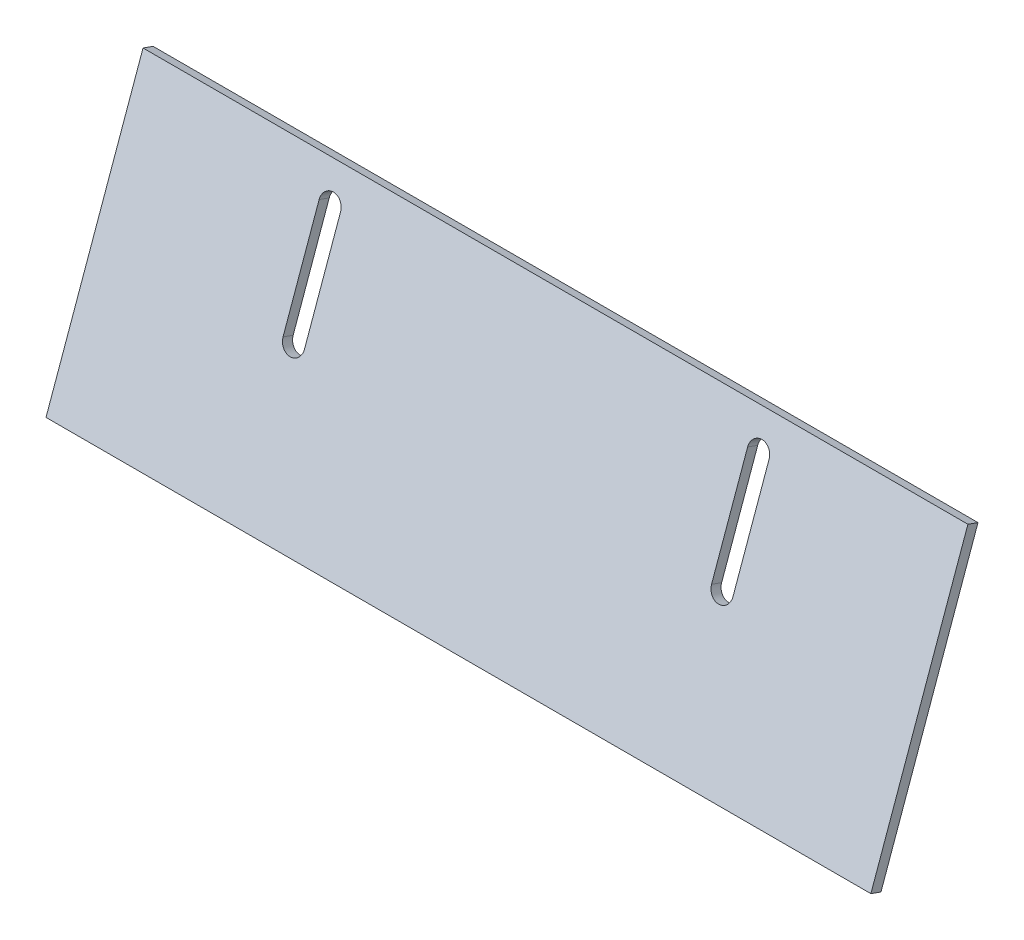
ISO-10303-21;
HEADER;
FILE_DESCRIPTION(('STEP AP214'),'2;1');
FILE_NAME('part.step','',(''),(''),'','','');
FILE_SCHEMA(('AUTOMOTIVE_DESIGN { 1 0 10303 214 1 1 1 1 }'));
ENDSEC;
DATA;
#1=APPLICATION_CONTEXT('core data for automotive mechanical design processes');
#2=APPLICATION_PROTOCOL_DEFINITION('international standard','automotive_design',2000,#1);
#3=PRODUCT_CONTEXT('',#1,'mechanical');
#4=PRODUCT('Part','Part','',(#3));
#5=PRODUCT_RELATED_PRODUCT_CATEGORY('part','',(#4));
#6=PRODUCT_DEFINITION_FORMATION('','',#4);
#7=PRODUCT_DEFINITION_CONTEXT('part definition',#1,'design');
#8=PRODUCT_DEFINITION('design','',#6,#7);
#9=PRODUCT_DEFINITION_SHAPE('','',#8);
#10=(LENGTH_UNIT() NAMED_UNIT(*) SI_UNIT(.MILLI.,.METRE.));
#11=(NAMED_UNIT(*) PLANE_ANGLE_UNIT() SI_UNIT($,.RADIAN.));
#12=(NAMED_UNIT(*) SI_UNIT($,.STERADIAN.) SOLID_ANGLE_UNIT());
#13=UNCERTAINTY_MEASURE_WITH_UNIT(LENGTH_MEASURE(1.E-05),#10,'distance_accuracy_value','');
#14=(GEOMETRIC_REPRESENTATION_CONTEXT(3) GLOBAL_UNCERTAINTY_ASSIGNED_CONTEXT((#13)) GLOBAL_UNIT_ASSIGNED_CONTEXT((#10,
#11,#12)) REPRESENTATION_CONTEXT('',''));
#15=CARTESIAN_POINT('',(0.,0.,0.));
#16=DIRECTION('',(0.,0.,1.));
#17=DIRECTION('',(1.,0.,0.));
#18=AXIS2_PLACEMENT_3D('',#15,#16,#17);
#19=CARTESIAN_POINT('',(80.,-304.701485296814,-282.765843381767));
#20=DIRECTION('',(0.,-0.33665169785031,-0.941629244625773));
#21=DIRECTION('',(0.,0.941629244625773,-0.33665169785031));
#22=AXIS2_PLACEMENT_3D('',#19,#20,#21);
#23=CYLINDRICAL_SURFACE('',#22,3.99999999999999);
#24=DIRECTION('',(0.,0.33665169785031,0.941629244625773));
#25=VECTOR('',#24,1.);
#26=CARTESIAN_POINT('',(84.,-304.701485296814,-282.765843381767));
#27=LINE('',#26,#25);
#28=CARTESIAN_POINT('',(84.,-306.048092088216,-286.53236036027));
#29=VERTEX_POINT('',#28);
#30=CARTESIAN_POINT('',(84.,-304.701485296814,-282.765843381767));
#31=VERTEX_POINT('',#30);
#32=EDGE_CURVE('E11',#29,#31,#27,.T.);
#33=ORIENTED_EDGE('',*,*,#32,.F.);
#34=CARTESIAN_POINT('',(80.,-306.048092088216,-286.53236036027));
#35=DIRECTION('',(0.,-0.33665169785031,-0.941629244625773));
#36=DIRECTION('',(0.,0.941629244625773,-0.33665169785031));
#37=AXIS2_PLACEMENT_3D('',#34,#35,#36);
#38=CIRCLE('',#37,3.99999999999999);
#39=CARTESIAN_POINT('',(76.,-306.048092088216,-286.53236036027));
#40=VERTEX_POINT('',#39);
#41=EDGE_CURVE('E116',#29,#40,#38,.T.);
#42=ORIENTED_EDGE('',*,*,#41,.T.);
#43=DIRECTION('',(0.,0.33665169785031,0.941629244625773));
#44=VECTOR('',#43,1.);
#45=CARTESIAN_POINT('',(76.,-304.701485296814,-282.765843381767));
#46=LINE('',#45,#44);
#47=CARTESIAN_POINT('',(76.,-304.701485296814,-282.765843381767));
#48=VERTEX_POINT('',#47);
#49=EDGE_CURVE('E47',#40,#48,#46,.T.);
#50=ORIENTED_EDGE('',*,*,#49,.T.);
#51=CARTESIAN_POINT('',(80.,-304.701485296814,-282.765843381767));
#52=DIRECTION('',(0.,-0.33665169785031,-0.941629244625773));
#53=DIRECTION('',(0.,0.941629244625773,-0.33665169785031));
#54=AXIS2_PLACEMENT_3D('',#51,#52,#53);
#55=CIRCLE('',#54,3.99999999999999);
#56=EDGE_CURVE('E158',#31,#48,#55,.T.);
#57=ORIENTED_EDGE('',*,*,#56,.F.);
#58=EDGE_LOOP('',(#33,#42,#50,#57));
#59=FACE_BOUND('',#58,.T.);
#60=ADVANCED_FACE('F37',(#59),#23,.F.);
#61=CARTESIAN_POINT('',(76.,-267.036315511784,-296.23191129578));
#62=DIRECTION('',(-1.,0.,0.));
#63=DIRECTION('',(0.,0.941629244625773,-0.33665169785031));
#64=AXIS2_PLACEMENT_3D('',#61,#62,#63);
#65=PLANE('',#64);
#66=ORIENTED_EDGE('',*,*,#49,.F.);
#67=DIRECTION('',(0.,0.941629244625773,-0.33665169785031));
#68=VECTOR('',#67,1.);
#69=CARTESIAN_POINT('',(76.,-125.516835200559,-351.075973988619));
#70=LINE('',#69,#68);
#71=CARTESIAN_POINT('',(76.,-268.382922303185,-299.998428274283));
#72=VERTEX_POINT('',#71);
#73=EDGE_CURVE('E128',#40,#72,#70,.T.);
#74=ORIENTED_EDGE('',*,*,#73,.T.);
#75=DIRECTION('',(0.,0.33665169785031,0.941629244625773));
#76=VECTOR('',#75,1.);
#77=CARTESIAN_POINT('',(76.,-267.036315511784,-296.23191129578));
#78=LINE('',#77,#76);
#79=CARTESIAN_POINT('',(76.,-267.036315511784,-296.23191129578));
#80=VERTEX_POINT('',#79);
#81=EDGE_CURVE('E55',#72,#80,#78,.T.);
#82=ORIENTED_EDGE('',*,*,#81,.T.);
#83=DIRECTION('',(0.,0.941629244625773,-0.33665169785031));
#84=VECTOR('',#83,1.);
#85=CARTESIAN_POINT('',(76.,-267.036315511784,-296.23191129578));
#86=LINE('',#85,#84);
#87=EDGE_CURVE('E145',#48,#80,#86,.T.);
#88=ORIENTED_EDGE('',*,*,#87,.F.);
#89=EDGE_LOOP('',(#66,#74,#82,#88));
#90=FACE_BOUND('',#89,.T.);
#91=ADVANCED_FACE('F163',(#90),#65,.F.);
#92=CARTESIAN_POINT('',(80.,-267.036315511784,-296.23191129578));
#93=DIRECTION('',(0.,-0.33665169785031,-0.941629244625773));
#94=DIRECTION('',(0.,0.941629244625773,-0.33665169785031));
#95=AXIS2_PLACEMENT_3D('',#92,#93,#94);
#96=CYLINDRICAL_SURFACE('',#95,3.99999999999999);
#97=ORIENTED_EDGE('',*,*,#81,.F.);
#98=CARTESIAN_POINT('',(80.,-268.382922303185,-299.998428274283));
#99=DIRECTION('',(0.,-0.33665169785031,-0.941629244625773));
#100=DIRECTION('',(0.,0.941629244625773,-0.33665169785031));
#101=AXIS2_PLACEMENT_3D('',#98,#99,#100);
#102=CIRCLE('',#101,3.99999999999999);
#103=CARTESIAN_POINT('',(84.,-268.382922303185,-299.998428274283));
#104=VERTEX_POINT('',#103);
#105=EDGE_CURVE('E115',#72,#104,#102,.T.);
#106=ORIENTED_EDGE('',*,*,#105,.T.);
#107=DIRECTION('',(0.,0.33665169785031,0.941629244625773));
#108=VECTOR('',#107,1.);
#109=CARTESIAN_POINT('',(84.,-267.036315511784,-296.23191129578));
#110=LINE('',#109,#108);
#111=CARTESIAN_POINT('',(84.,-267.036315511784,-296.23191129578));
#112=VERTEX_POINT('',#111);
#113=EDGE_CURVE('E41',#104,#112,#110,.T.);
#114=ORIENTED_EDGE('',*,*,#113,.T.);
#115=CARTESIAN_POINT('',(80.,-267.036315511784,-296.23191129578));
#116=DIRECTION('',(0.,-0.33665169785031,-0.941629244625773));
#117=DIRECTION('',(0.,0.941629244625773,-0.33665169785031));
#118=AXIS2_PLACEMENT_3D('',#115,#116,#117);
#119=CIRCLE('',#118,3.99999999999999);
#120=EDGE_CURVE('E247',#80,#112,#119,.T.);
#121=ORIENTED_EDGE('',*,*,#120,.F.);
#122=EDGE_LOOP('',(#97,#106,#114,#121));
#123=FACE_BOUND('',#122,.T.);
#124=ADVANCED_FACE('F118',(#123),#96,.F.);
#125=CARTESIAN_POINT('',(-76.,-267.036315511784,-296.231911295779));
#126=DIRECTION('',(-1.,0.,0.));
#127=DIRECTION('',(0.,0.941629244625773,-0.33665169785031));
#128=AXIS2_PLACEMENT_3D('',#125,#126,#127);
#129=PLANE('',#128);
#130=DIRECTION('',(0.,0.33665169785031,0.941629244625773));
#131=VECTOR('',#130,1.);
#132=CARTESIAN_POINT('',(-76.,-267.036315511784,-296.231911295779));
#133=LINE('',#132,#131);
#134=CARTESIAN_POINT('',(-76.,-268.382922303185,-299.998428274283));
#135=VERTEX_POINT('',#134);
#136=CARTESIAN_POINT('',(-76.,-267.036315511784,-296.231911295779));
#137=VERTEX_POINT('',#136);
#138=EDGE_CURVE('E110',#135,#137,#133,.T.);
#139=ORIENTED_EDGE('',*,*,#138,.F.);
#140=DIRECTION('',(0.,0.941629244625773,-0.33665169785031));
#141=VECTOR('',#140,1.);
#142=CARTESIAN_POINT('',(-76.,-125.516835200559,-351.075973988619));
#143=LINE('',#142,#141);
#144=CARTESIAN_POINT('',(-76.,-306.048092088216,-286.53236036027));
#145=VERTEX_POINT('',#144);
#146=EDGE_CURVE('E122',#145,#135,#143,.T.);
#147=ORIENTED_EDGE('',*,*,#146,.F.);
#148=DIRECTION('',(0.,0.33665169785031,0.941629244625773));
#149=VECTOR('',#148,1.);
#150=CARTESIAN_POINT('',(-76.,-304.701485296814,-282.765843381767));
#151=LINE('',#150,#149);
#152=CARTESIAN_POINT('',(-76.,-304.701485296814,-282.765843381767));
#153=VERTEX_POINT('',#152);
#154=EDGE_CURVE('E149',#145,#153,#151,.T.);
#155=ORIENTED_EDGE('',*,*,#154,.T.);
#156=DIRECTION('',(0.,0.941629244625773,-0.33665169785031));
#157=VECTOR('',#156,1.);
#158=CARTESIAN_POINT('',(-76.,-267.036315511784,-296.231911295779));
#159=LINE('',#158,#157);
#160=EDGE_CURVE('E243',#153,#137,#159,.T.);
#161=ORIENTED_EDGE('',*,*,#160,.T.);
#162=EDGE_LOOP('',(#139,#147,#155,#161));
#163=FACE_BOUND('',#162,.T.);
#164=ADVANCED_FACE('F250',(#163),#129,.T.);
#165=CARTESIAN_POINT('',(-80.,-304.701485296814,-282.765843381767));
#166=DIRECTION('',(0.,-0.33665169785031,-0.941629244625773));
#167=DIRECTION('',(0.,0.941629244625773,-0.33665169785031));
#168=AXIS2_PLACEMENT_3D('',#165,#166,#167);
#169=CYLINDRICAL_SURFACE('',#168,3.99999999999999);
#170=ORIENTED_EDGE('',*,*,#154,.F.);
#171=CARTESIAN_POINT('',(-80.,-306.048092088216,-286.53236036027));
#172=DIRECTION('',(0.,-0.33665169785031,-0.941629244625773));
#173=DIRECTION('',(0.,0.941629244625773,-0.33665169785031));
#174=AXIS2_PLACEMENT_3D('',#171,#172,#173);
#175=CIRCLE('',#174,3.99999999999999);
#176=CARTESIAN_POINT('',(-84.,-306.048092088216,-286.53236036027));
#177=VERTEX_POINT('',#176);
#178=EDGE_CURVE('E119',#177,#145,#175,.F.);
#179=ORIENTED_EDGE('',*,*,#178,.F.);
#180=DIRECTION('',(0.,0.33665169785031,0.941629244625773));
#181=VECTOR('',#180,1.);
#182=CARTESIAN_POINT('',(-84.,-304.701485296814,-282.765843381767));
#183=LINE('',#182,#181);
#184=CARTESIAN_POINT('',(-84.,-304.701485296814,-282.765843381767));
#185=VERTEX_POINT('',#184);
#186=EDGE_CURVE('E146',#177,#185,#183,.T.);
#187=ORIENTED_EDGE('',*,*,#186,.T.);
#188=CARTESIAN_POINT('',(-80.,-304.701485296814,-282.765843381767));
#189=DIRECTION('',(0.,-0.33665169785031,-0.941629244625773));
#190=DIRECTION('',(0.,0.941629244625773,-0.33665169785031));
#191=AXIS2_PLACEMENT_3D('',#188,#189,#190);
#192=CIRCLE('',#191,3.99999999999999);
#193=EDGE_CURVE('E201',#185,#153,#192,.F.);
#194=ORIENTED_EDGE('',*,*,#193,.T.);
#195=EDGE_LOOP('',(#170,#179,#187,#194));
#196=FACE_BOUND('',#195,.T.);
#197=ADVANCED_FACE('F199',(#196),#169,.F.);
#198=CARTESIAN_POINT('',(-84.,-267.036315511784,-296.23191129578));
#199=DIRECTION('',(1.,0.,0.));
#200=DIRECTION('',(0.,-0.941629244625773,0.33665169785031));
#201=AXIS2_PLACEMENT_3D('',#198,#199,#200);
#202=PLANE('',#201);
#203=ORIENTED_EDGE('',*,*,#186,.F.);
#204=DIRECTION('',(0.,0.941629244625773,-0.33665169785031));
#205=VECTOR('',#204,1.);
#206=CARTESIAN_POINT('',(-84.,-125.516835200559,-351.075973988619));
#207=LINE('',#206,#205);
#208=CARTESIAN_POINT('',(-84.,-268.382922303185,-299.998428274283));
#209=VERTEX_POINT('',#208);
#210=EDGE_CURVE('E174',#209,#177,#207,.F.);
#211=ORIENTED_EDGE('',*,*,#210,.F.);
#212=DIRECTION('',(0.,0.33665169785031,0.941629244625773));
#213=VECTOR('',#212,1.);
#214=CARTESIAN_POINT('',(-84.,-267.036315511784,-296.23191129578));
#215=LINE('',#214,#213);
#216=CARTESIAN_POINT('',(-84.,-267.036315511784,-296.23191129578));
#217=VERTEX_POINT('',#216);
#218=EDGE_CURVE('E142',#209,#217,#215,.T.);
#219=ORIENTED_EDGE('',*,*,#218,.T.);
#220=DIRECTION('',(0.,-0.941629244625773,0.33665169785031));
#221=VECTOR('',#220,1.);
#222=CARTESIAN_POINT('',(-84.,-267.036315511784,-296.23191129578));
#223=LINE('',#222,#221);
#224=EDGE_CURVE('E195',#217,#185,#223,.T.);
#225=ORIENTED_EDGE('',*,*,#224,.T.);
#226=EDGE_LOOP('',(#203,#211,#219,#225));
#227=FACE_BOUND('',#226,.T.);
#228=ADVANCED_FACE('F190',(#227),#202,.T.);
#229=CARTESIAN_POINT('',(-154.,-255.144486959831,-300.483483021497));
#230=DIRECTION('',(-1.,0.,0.));
#231=DIRECTION('',(0.,0.941629244625773,-0.33665169785031));
#232=AXIS2_PLACEMENT_3D('',#229,#230,#231);
#233=PLANE('',#232);
#234=DIRECTION('',(0.,0.33665169785031,0.941629244625773));
#235=VECTOR('',#234,1.);
#236=CARTESIAN_POINT('',(-154.,-255.144486959831,-300.483483021497));
#237=LINE('',#236,#235);
#238=CARTESIAN_POINT('',(-154.,-256.491093751232,-304.25));
#239=VERTEX_POINT('',#238);
#240=CARTESIAN_POINT('',(-154.,-255.144486959831,-300.483483021497));
#241=VERTEX_POINT('',#240);
#242=EDGE_CURVE('E139',#239,#241,#237,.T.);
#243=ORIENTED_EDGE('',*,*,#242,.F.);
#244=DIRECTION('',(0.,0.941629244625773,-0.33665169785031));
#245=VECTOR('',#244,1.);
#246=CARTESIAN_POINT('',(-154.,-125.516835200559,-351.075973988619));
#247=LINE('',#246,#245);
#248=CARTESIAN_POINT('',(-154.,-357.837700542633,-268.016516978503));
#249=VERTEX_POINT('',#248);
#250=EDGE_CURVE('E175',#249,#239,#247,.T.);
#251=ORIENTED_EDGE('',*,*,#250,.F.);
#252=DIRECTION('',(0.,0.33665169785031,0.941629244625773));
#253=VECTOR('',#252,1.);
#254=CARTESIAN_POINT('',(-154.,-356.491093751232,-264.25));
#255=LINE('',#254,#253);
#256=CARTESIAN_POINT('',(-154.,-356.491093751232,-264.25));
#257=VERTEX_POINT('',#256);
#258=EDGE_CURVE('E135',#249,#257,#255,.T.);
#259=ORIENTED_EDGE('',*,*,#258,.T.);
#260=DIRECTION('',(0.,0.941629244625773,-0.33665169785031));
#261=VECTOR('',#260,1.);
#262=CARTESIAN_POINT('',(-154.,-255.144486959831,-300.483483021497));
#263=LINE('',#262,#261);
#264=EDGE_CURVE('E234',#257,#241,#263,.T.);
#265=ORIENTED_EDGE('',*,*,#264,.T.);
#266=EDGE_LOOP('',(#243,#251,#259,#265));
#267=FACE_BOUND('',#266,.T.);
#268=ADVANCED_FACE('F277',(#267),#233,.T.);
#269=CARTESIAN_POINT('',(154.,-356.491093751232,-264.25));
#270=DIRECTION('',(0.,-0.941629244625773,0.33665169785031));
#271=DIRECTION('',(-1.,0.,0.));
#272=AXIS2_PLACEMENT_3D('',#269,#270,#271);
#273=PLANE('',#272);
#274=ORIENTED_EDGE('',*,*,#258,.F.);
#275=DIRECTION('',(1.,0.,0.));
#276=VECTOR('',#275,1.);
#277=CARTESIAN_POINT('',(0.,-357.837700542633,-268.016516978503));
#278=LINE('',#277,#276);
#279=CARTESIAN_POINT('',(154.,-357.837700542633,-268.016516978503));
#280=VERTEX_POINT('',#279);
#281=EDGE_CURVE('E171',#280,#249,#278,.F.);
#282=ORIENTED_EDGE('',*,*,#281,.F.);
#283=DIRECTION('',(0.,0.33665169785031,0.941629244625773));
#284=VECTOR('',#283,1.);
#285=CARTESIAN_POINT('',(154.,-356.491093751232,-264.25));
#286=LINE('',#285,#284);
#287=CARTESIAN_POINT('',(154.,-356.491093751232,-264.25));
#288=VERTEX_POINT('',#287);
#289=EDGE_CURVE('E132',#280,#288,#286,.T.);
#290=ORIENTED_EDGE('',*,*,#289,.T.);
#291=DIRECTION('',(-1.,0.,0.));
#292=VECTOR('',#291,1.);
#293=CARTESIAN_POINT('',(154.,-356.491093751232,-264.25));
#294=LINE('',#293,#292);
#295=EDGE_CURVE('E231',#288,#257,#294,.T.);
#296=ORIENTED_EDGE('',*,*,#295,.T.);
#297=EDGE_LOOP('',(#274,#282,#290,#296));
#298=FACE_BOUND('',#297,.T.);
#299=ADVANCED_FACE('F281',(#298),#273,.T.);
#300=CARTESIAN_POINT('',(154.,-255.144486959831,-300.483483021497));
#301=DIRECTION('',(1.,0.,0.));
#302=DIRECTION('',(0.,-0.941629244625773,0.33665169785031));
#303=AXIS2_PLACEMENT_3D('',#300,#301,#302);
#304=PLANE('',#303);
#305=ORIENTED_EDGE('',*,*,#289,.F.);
#306=DIRECTION('',(0.,0.941629244625773,-0.33665169785031));
#307=VECTOR('',#306,1.);
#308=CARTESIAN_POINT('',(154.,-125.516835200559,-351.075973988619));
#309=LINE('',#308,#307);
#310=CARTESIAN_POINT('',(154.,-256.491093751232,-304.25));
#311=VERTEX_POINT('',#310);
#312=EDGE_CURVE('E167',#311,#280,#309,.F.);
#313=ORIENTED_EDGE('',*,*,#312,.F.);
#314=DIRECTION('',(0.,0.33665169785031,0.941629244625773));
#315=VECTOR('',#314,1.);
#316=CARTESIAN_POINT('',(154.,-255.144486959831,-300.483483021497));
#317=LINE('',#316,#315);
#318=CARTESIAN_POINT('',(154.,-255.144486959831,-300.483483021497));
#319=VERTEX_POINT('',#318);
#320=EDGE_CURVE('E136',#311,#319,#317,.T.);
#321=ORIENTED_EDGE('',*,*,#320,.T.);
#322=DIRECTION('',(0.,-0.941629244625773,0.33665169785031));
#323=VECTOR('',#322,1.);
#324=CARTESIAN_POINT('',(154.,-255.144486959831,-300.483483021497));
#325=LINE('',#324,#323);
#326=EDGE_CURVE('E130',#319,#288,#325,.T.);
#327=ORIENTED_EDGE('',*,*,#326,.T.);
#328=EDGE_LOOP('',(#305,#313,#321,#327));
#329=FACE_BOUND('',#328,.T.);
#330=ADVANCED_FACE('F219',(#329),#304,.T.);
#331=CARTESIAN_POINT('',(154.,-255.144486959831,-300.483483021497));
#332=DIRECTION('',(0.,0.941629244625773,-0.33665169785031));
#333=DIRECTION('',(1.,0.,0.));
#334=AXIS2_PLACEMENT_3D('',#331,#332,#333);
#335=PLANE('',#334);
#336=DIRECTION('',(1.,0.,0.));
#337=VECTOR('',#336,1.);
#338=CARTESIAN_POINT('',(0.,-256.491093751232,-304.25));
#339=LINE('',#338,#337);
#340=EDGE_CURVE('E170',#239,#311,#339,.T.);
#341=ORIENTED_EDGE('',*,*,#340,.F.);
#342=ORIENTED_EDGE('',*,*,#242,.T.);
#343=DIRECTION('',(1.,0.,0.));
#344=VECTOR('',#343,1.);
#345=CARTESIAN_POINT('',(154.,-255.144486959831,-300.483483021497));
#346=LINE('',#345,#344);
#347=EDGE_CURVE('E228',#241,#319,#346,.T.);
#348=ORIENTED_EDGE('',*,*,#347,.T.);
#349=ORIENTED_EDGE('',*,*,#320,.F.);
#350=EDGE_LOOP('',(#341,#342,#348,#349));
#351=FACE_BOUND('',#350,.T.);
#352=ADVANCED_FACE('F233',(#351),#335,.T.);
#353=CARTESIAN_POINT('',(-80.,-267.036315511784,-296.231911295779));
#354=DIRECTION('',(0.,-0.33665169785031,-0.941629244625773));
#355=DIRECTION('',(0.,0.941629244625773,-0.33665169785031));
#356=AXIS2_PLACEMENT_3D('',#353,#354,#355);
#357=CYLINDRICAL_SURFACE('',#356,3.99999999999999);
#358=CARTESIAN_POINT('',(-80.,-268.382922303185,-299.998428274283));
#359=DIRECTION('',(0.,-0.33665169785031,-0.941629244625773));
#360=DIRECTION('',(0.,0.941629244625773,-0.33665169785031));
#361=AXIS2_PLACEMENT_3D('',#358,#359,#360);
#362=CIRCLE('',#361,3.99999999999999);
#363=EDGE_CURVE('E126',#135,#209,#362,.F.);
#364=ORIENTED_EDGE('',*,*,#363,.F.);
#365=ORIENTED_EDGE('',*,*,#138,.T.);
#366=CARTESIAN_POINT('',(-80.,-267.036315511784,-296.231911295779));
#367=DIRECTION('',(0.,-0.33665169785031,-0.941629244625773));
#368=DIRECTION('',(0.,0.941629244625773,-0.33665169785031));
#369=AXIS2_PLACEMENT_3D('',#366,#367,#368);
#370=CIRCLE('',#369,3.99999999999999);
#371=EDGE_CURVE('E240',#137,#217,#370,.F.);
#372=ORIENTED_EDGE('',*,*,#371,.T.);
#373=ORIENTED_EDGE('',*,*,#218,.F.);
#374=EDGE_LOOP('',(#364,#365,#372,#373));
#375=FACE_BOUND('',#374,.T.);
#376=ADVANCED_FACE('F252',(#375),#357,.F.);
#377=CARTESIAN_POINT('',(84.,-267.036315511784,-296.23191129578));
#378=DIRECTION('',(1.,0.,0.));
#379=DIRECTION('',(0.,-0.941629244625773,0.33665169785031));
#380=AXIS2_PLACEMENT_3D('',#377,#378,#379);
#381=PLANE('',#380);
#382=DIRECTION('',(0.,0.941629244625773,-0.33665169785031));
#383=VECTOR('',#382,1.);
#384=CARTESIAN_POINT('',(84.,-125.516835200559,-351.075973988619));
#385=LINE('',#384,#383);
#386=EDGE_CURVE('E103',#104,#29,#385,.F.);
#387=ORIENTED_EDGE('',*,*,#386,.T.);
#388=ORIENTED_EDGE('',*,*,#32,.T.);
#389=DIRECTION('',(0.,-0.941629244625773,0.33665169785031));
#390=VECTOR('',#389,1.);
#391=CARTESIAN_POINT('',(84.,-267.036315511784,-296.23191129578));
#392=LINE('',#391,#390);
#393=EDGE_CURVE('E106',#112,#31,#392,.T.);
#394=ORIENTED_EDGE('',*,*,#393,.F.);
#395=ORIENTED_EDGE('',*,*,#113,.F.);
#396=EDGE_LOOP('',(#387,#388,#394,#395));
#397=FACE_BOUND('',#396,.T.);
#398=ADVANCED_FACE('F39',(#397),#381,.F.);
#399=CARTESIAN_POINT('',(0.,-124.170228409158,-347.309457010116));
#400=DIRECTION('',(0.,-0.33665169785031,-0.941629244625773));
#401=DIRECTION('',(0.,0.941629244625773,-0.33665169785031));
#402=AXIS2_PLACEMENT_3D('',#399,#400,#401);
#403=PLANE('',#402);
#404=ORIENTED_EDGE('',*,*,#326,.F.);
#405=ORIENTED_EDGE('',*,*,#347,.F.);
#406=ORIENTED_EDGE('',*,*,#264,.F.);
#407=ORIENTED_EDGE('',*,*,#295,.F.);
#408=EDGE_LOOP('',(#404,#405,#406,#407));
#409=FACE_BOUND('',#408,.T.);
#410=ORIENTED_EDGE('',*,*,#224,.F.);
#411=ORIENTED_EDGE('',*,*,#371,.F.);
#412=ORIENTED_EDGE('',*,*,#160,.F.);
#413=ORIENTED_EDGE('',*,*,#193,.F.);
#414=EDGE_LOOP('',(#410,#411,#412,#413));
#415=FACE_BOUND('',#414,.T.);
#416=ORIENTED_EDGE('',*,*,#120,.T.);
#417=ORIENTED_EDGE('',*,*,#393,.T.);
#418=ORIENTED_EDGE('',*,*,#56,.T.);
#419=ORIENTED_EDGE('',*,*,#87,.T.);
#420=EDGE_LOOP('',(#416,#417,#418,#419));
#421=FACE_BOUND('',#420,.T.);
#422=ADVANCED_FACE('F161',(#409,#415,#421),#403,.F.);
#423=CARTESIAN_POINT('',(0.,-125.516835200559,-351.075973988619));
#424=DIRECTION('',(0.,-0.33665169785031,-0.941629244625773));
#425=DIRECTION('',(0.,0.941629244625773,-0.33665169785031));
#426=AXIS2_PLACEMENT_3D('',#423,#424,#425);
#427=PLANE('',#426);
#428=ORIENTED_EDGE('',*,*,#312,.T.);
#429=ORIENTED_EDGE('',*,*,#281,.T.);
#430=ORIENTED_EDGE('',*,*,#250,.T.);
#431=ORIENTED_EDGE('',*,*,#340,.T.);
#432=EDGE_LOOP('',(#428,#429,#430,#431));
#433=FACE_BOUND('',#432,.T.);
#434=ORIENTED_EDGE('',*,*,#210,.T.);
#435=ORIENTED_EDGE('',*,*,#178,.T.);
#436=ORIENTED_EDGE('',*,*,#146,.T.);
#437=ORIENTED_EDGE('',*,*,#363,.T.);
#438=EDGE_LOOP('',(#434,#435,#436,#437));
#439=FACE_BOUND('',#438,.T.);
#440=ORIENTED_EDGE('',*,*,#105,.F.);
#441=ORIENTED_EDGE('',*,*,#73,.F.);
#442=ORIENTED_EDGE('',*,*,#41,.F.);
#443=ORIENTED_EDGE('',*,*,#386,.F.);
#444=EDGE_LOOP('',(#440,#441,#442,#443));
#445=FACE_BOUND('',#444,.T.);
#446=ADVANCED_FACE('F113',(#433,#439,#445),#427,.T.);
#447=CLOSED_SHELL('',(#60,#91,#124,#164,#197,#228,#268,#299,#330,#352,#376,#398,#422,#446));
#448=MANIFOLD_SOLID_BREP('B2',#447);
#449=ADVANCED_BREP_SHAPE_REPRESENTATION('',(#18,#448),#14);
#450=SHAPE_DEFINITION_REPRESENTATION(#9,#449);
ENDSEC;
END-ISO-10303-21;
